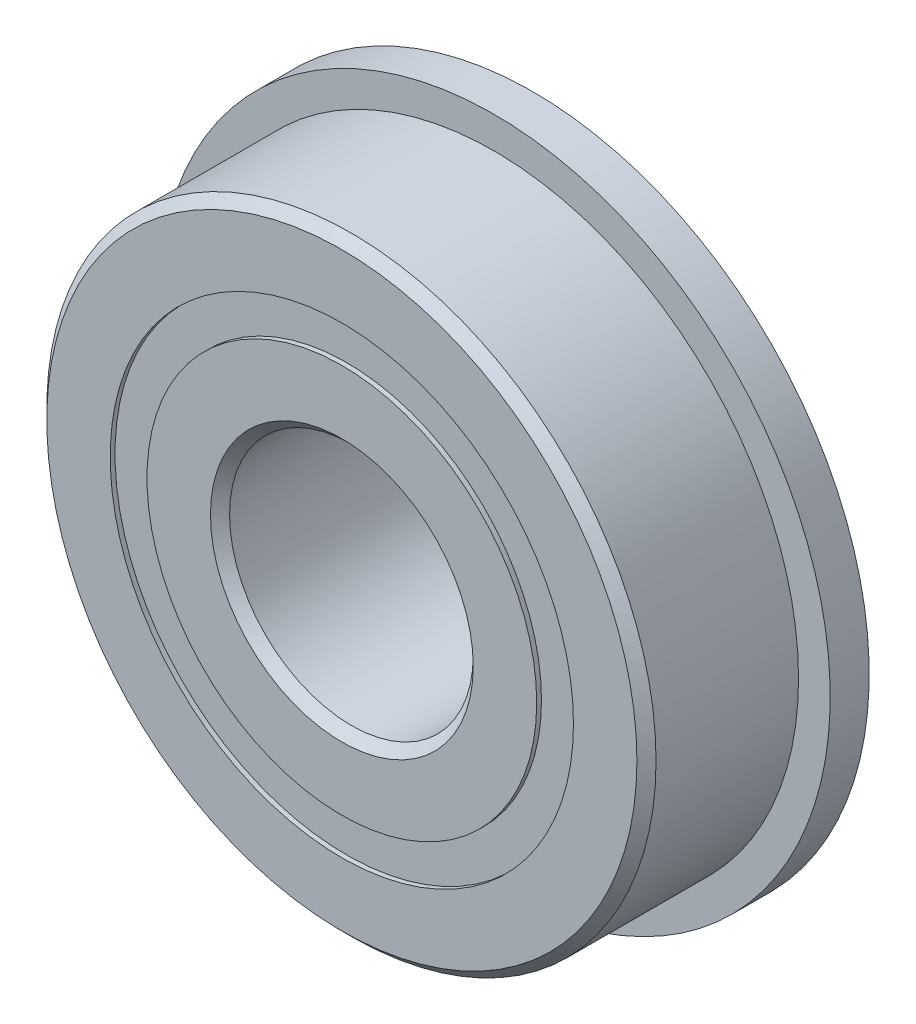
ISO-10303-21;
HEADER;
FILE_DESCRIPTION(('STEP AP214'),'2;1');
FILE_NAME('part.step','',(''),(''),'','','');
FILE_SCHEMA(('AUTOMOTIVE_DESIGN { 1 0 10303 214 1 1 1 1 }'));
ENDSEC;
DATA;
#1=APPLICATION_CONTEXT('core data for automotive mechanical design processes');
#2=APPLICATION_PROTOCOL_DEFINITION('international standard','automotive_design',2000,#1);
#3=PRODUCT_CONTEXT('',#1,'mechanical');
#4=PRODUCT('Part','Part','',(#3));
#5=PRODUCT_RELATED_PRODUCT_CATEGORY('part','',(#4));
#6=PRODUCT_DEFINITION_FORMATION('','',#4);
#7=PRODUCT_DEFINITION_CONTEXT('part definition',#1,'design');
#8=PRODUCT_DEFINITION('design','',#6,#7);
#9=PRODUCT_DEFINITION_SHAPE('','',#8);
#10=(LENGTH_UNIT() NAMED_UNIT(*) SI_UNIT(.MILLI.,.METRE.));
#11=(NAMED_UNIT(*) PLANE_ANGLE_UNIT() SI_UNIT($,.RADIAN.));
#12=(NAMED_UNIT(*) SI_UNIT($,.STERADIAN.) SOLID_ANGLE_UNIT());
#13=UNCERTAINTY_MEASURE_WITH_UNIT(LENGTH_MEASURE(1.E-05),#10,'distance_accuracy_value','');
#14=(GEOMETRIC_REPRESENTATION_CONTEXT(3) GLOBAL_UNCERTAINTY_ASSIGNED_CONTEXT((#13)) GLOBAL_UNIT_ASSIGNED_CONTEXT((#10,
#11,#12)) REPRESENTATION_CONTEXT('',''));
#15=CARTESIAN_POINT('',(0.,0.,0.));
#16=DIRECTION('',(0.,0.,1.));
#17=DIRECTION('',(1.,0.,0.));
#18=AXIS2_PLACEMENT_3D('',#15,#16,#17);
#19=CARTESIAN_POINT('',(0.,6.03522142857143,-2.36474));
#20=DIRECTION('',(0.,0.,1.));
#21=DIRECTION('',(1.,0.,0.));
#22=AXIS2_PLACEMENT_3D('',#19,#20,#21);
#23=PLANE('',#22);
#24=CARTESIAN_POINT('',(0.,0.,-2.36474));
#25=DIRECTION('',(0.,0.,1.));
#26=DIRECTION('',(1.,0.,0.));
#27=AXIS2_PLACEMENT_3D('',#24,#25,#26);
#28=CIRCLE('',#27,6.03522142857143);
#29=CARTESIAN_POINT('',(6.03522142857143,0.,-2.36474));
#30=VERTEX_POINT('',#29);
#31=EDGE_CURVE('E68',#30,#30,#28,.T.);
#32=ORIENTED_EDGE('',*,*,#31,.F.);
#33=EDGE_LOOP('',(#32));
#34=FACE_BOUND('',#33,.T.);
#35=CARTESIAN_POINT('',(0.,0.,-2.36474));
#36=DIRECTION('',(0.,0.,1.));
#37=DIRECTION('',(1.,0.,0.));
#38=AXIS2_PLACEMENT_3D('',#35,#36,#37);
#39=CIRCLE('',#38,5.07727857142857);
#40=CARTESIAN_POINT('',(5.07727857142857,0.,-2.36474));
#41=VERTEX_POINT('',#40);
#42=EDGE_CURVE('E11',#41,#41,#39,.T.);
#43=ORIENTED_EDGE('',*,*,#42,.T.);
#44=EDGE_LOOP('',(#43));
#45=FACE_BOUND('',#44,.T.);
#46=ADVANCED_FACE('F49',(#34,#45),#23,.F.);
#47=CARTESIAN_POINT('',(0.,0.,2.4892));
#48=DIRECTION('',(0.,0.,1.));
#49=DIRECTION('',(1.,0.,0.));
#50=AXIS2_PLACEMENT_3D('',#47,#48,#49);
#51=CYLINDRICAL_SURFACE('',#50,5.07727857142857);
#52=ORIENTED_EDGE('',*,*,#42,.F.);
#53=EDGE_LOOP('',(#52));
#54=FACE_BOUND('',#53,.T.);
#55=CARTESIAN_POINT('',(0.,0.,-1.20554465033679));
#56=DIRECTION('',(0.,0.,1.));
#57=DIRECTION('',(1.,0.,0.));
#58=AXIS2_PLACEMENT_3D('',#55,#56,#57);
#59=CIRCLE('',#58,5.07727857142857);
#60=CARTESIAN_POINT('',(5.07727857142857,0.,-1.20554465033679));
#61=VERTEX_POINT('',#60);
#62=EDGE_CURVE('E56',#61,#61,#59,.T.);
#63=ORIENTED_EDGE('',*,*,#62,.T.);
#64=EDGE_LOOP('',(#63));
#65=FACE_BOUND('',#64,.T.);
#66=ADVANCED_FACE('F79',(#54,#65),#51,.F.);
#67=CARTESIAN_POINT('',(0.,6.03522142857143,-1.20554465033679));
#68=DIRECTION('',(0.,0.,-1.));
#69=DIRECTION('',(-1.,0.,0.));
#70=AXIS2_PLACEMENT_3D('',#67,#68,#69);
#71=PLANE('',#70);
#72=ORIENTED_EDGE('',*,*,#62,.F.);
#73=EDGE_LOOP('',(#72));
#74=FACE_BOUND('',#73,.T.);
#75=CARTESIAN_POINT('',(0.,0.,-1.20554465033679));
#76=DIRECTION('',(0.,0.,1.));
#77=DIRECTION('',(1.,0.,0.));
#78=AXIS2_PLACEMENT_3D('',#75,#76,#77);
#79=CIRCLE('',#78,6.03522142857143);
#80=CARTESIAN_POINT('',(6.03522142857143,0.,-1.20554465033679));
#81=VERTEX_POINT('',#80);
#82=EDGE_CURVE('E62',#81,#81,#79,.T.);
#83=ORIENTED_EDGE('',*,*,#82,.T.);
#84=EDGE_LOOP('',(#83));
#85=FACE_BOUND('',#84,.T.);
#86=ADVANCED_FACE('F83',(#74,#85),#71,.F.);
#87=CARTESIAN_POINT('',(0.,0.,2.4892));
#88=DIRECTION('',(0.,0.,1.));
#89=DIRECTION('',(1.,0.,0.));
#90=AXIS2_PLACEMENT_3D('',#87,#88,#89);
#91=CYLINDRICAL_SURFACE('',#90,6.03522142857143);
#92=ORIENTED_EDGE('',*,*,#82,.F.);
#93=EDGE_LOOP('',(#92));
#94=FACE_BOUND('',#93,.T.);
#95=ORIENTED_EDGE('',*,*,#31,.T.);
#96=EDGE_LOOP('',(#95));
#97=FACE_BOUND('',#96,.T.);
#98=ADVANCED_FACE('F76',(#94,#97),#91,.T.);
#99=CLOSED_SHELL('',(#46,#66,#86,#98));
#100=MANIFOLD_SOLID_BREP('B2',#99);
#101=CARTESIAN_POINT('',(0.,6.03522142857143,2.36474));
#102=DIRECTION('',(0.,0.,-1.));
#103=DIRECTION('',(-1.,0.,0.));
#104=AXIS2_PLACEMENT_3D('',#101,#102,#103);
#105=PLANE('',#104);
#106=CARTESIAN_POINT('',(0.,0.,2.36474));
#107=DIRECTION('',(0.,0.,1.));
#108=DIRECTION('',(1.,0.,0.));
#109=AXIS2_PLACEMENT_3D('',#106,#107,#108);
#110=CIRCLE('',#109,5.07727857142857);
#111=CARTESIAN_POINT('',(5.07727857142857,0.,2.36474));
#112=VERTEX_POINT('',#111);
#113=EDGE_CURVE('E48',#112,#112,#110,.T.);
#114=ORIENTED_EDGE('',*,*,#113,.F.);
#115=EDGE_LOOP('',(#114));
#116=FACE_BOUND('',#115,.T.);
#117=CARTESIAN_POINT('',(0.,0.,2.36474));
#118=DIRECTION('',(0.,0.,1.));
#119=DIRECTION('',(1.,0.,0.));
#120=AXIS2_PLACEMENT_3D('',#117,#118,#119);
#121=CIRCLE('',#120,6.03522142857143);
#122=CARTESIAN_POINT('',(6.03522142857143,0.,2.36474));
#123=VERTEX_POINT('',#122);
#124=EDGE_CURVE('E151',#123,#123,#121,.T.);
#125=ORIENTED_EDGE('',*,*,#124,.T.);
#126=EDGE_LOOP('',(#125));
#127=FACE_BOUND('',#126,.T.);
#128=ADVANCED_FACE('F132',(#116,#127),#105,.F.);
#129=CARTESIAN_POINT('',(0.,0.,2.4892));
#130=DIRECTION('',(0.,0.,1.));
#131=DIRECTION('',(1.,0.,0.));
#132=AXIS2_PLACEMENT_3D('',#129,#130,#131);
#133=CYLINDRICAL_SURFACE('',#132,5.07727857142857);
#134=CARTESIAN_POINT('',(0.,0.,1.20554465033679));
#135=DIRECTION('',(0.,0.,1.));
#136=DIRECTION('',(1.,0.,0.));
#137=AXIS2_PLACEMENT_3D('',#134,#135,#136);
#138=CIRCLE('',#137,5.07727857142857);
#139=CARTESIAN_POINT('',(5.07727857142857,0.,1.20554465033679));
#140=VERTEX_POINT('',#139);
#141=EDGE_CURVE('E139',#140,#140,#138,.T.);
#142=ORIENTED_EDGE('',*,*,#141,.F.);
#143=EDGE_LOOP('',(#142));
#144=FACE_BOUND('',#143,.T.);
#145=ORIENTED_EDGE('',*,*,#113,.T.);
#146=EDGE_LOOP('',(#145));
#147=FACE_BOUND('',#146,.T.);
#148=ADVANCED_FACE('F168',(#144,#147),#133,.F.);
#149=CARTESIAN_POINT('',(0.,6.03522142857143,1.20554465033679));
#150=DIRECTION('',(0.,0.,1.));
#151=DIRECTION('',(1.,0.,0.));
#152=AXIS2_PLACEMENT_3D('',#149,#150,#151);
#153=PLANE('',#152);
#154=CARTESIAN_POINT('',(0.,0.,1.20554465033679));
#155=DIRECTION('',(0.,0.,1.));
#156=DIRECTION('',(1.,0.,0.));
#157=AXIS2_PLACEMENT_3D('',#154,#155,#156);
#158=CIRCLE('',#157,6.03522142857143);
#159=CARTESIAN_POINT('',(6.03522142857143,0.,1.20554465033679));
#160=VERTEX_POINT('',#159);
#161=EDGE_CURVE('E145',#160,#160,#158,.T.);
#162=ORIENTED_EDGE('',*,*,#161,.F.);
#163=EDGE_LOOP('',(#162));
#164=FACE_BOUND('',#163,.T.);
#165=ORIENTED_EDGE('',*,*,#141,.T.);
#166=EDGE_LOOP('',(#165));
#167=FACE_BOUND('',#166,.T.);
#168=ADVANCED_FACE('F163',(#164,#167),#153,.F.);
#169=CARTESIAN_POINT('',(0.,0.,2.4892));
#170=DIRECTION('',(0.,0.,1.));
#171=DIRECTION('',(1.,0.,0.));
#172=AXIS2_PLACEMENT_3D('',#169,#170,#171);
#173=CYLINDRICAL_SURFACE('',#172,6.03522142857143);
#174=ORIENTED_EDGE('',*,*,#124,.F.);
#175=EDGE_LOOP('',(#174));
#176=FACE_BOUND('',#175,.T.);
#177=ORIENTED_EDGE('',*,*,#161,.T.);
#178=EDGE_LOOP('',(#177));
#179=FACE_BOUND('',#178,.T.);
#180=ADVANCED_FACE('F160',(#176,#179),#173,.T.);
#181=CLOSED_SHELL('',(#128,#148,#168,#180));
#182=MANIFOLD_SOLID_BREP('B6',#181);
#183=CARTESIAN_POINT('',(-2.41076652547187,5.00600827228285,0.));
#184=DIRECTION('',(0.,0.,1.));
#185=DIRECTION('',(-0.433883739117546,0.900968867902425,0.));
#186=AXIS2_PLACEMENT_3D('',#183,#184,#185);
#187=SPHERICAL_SURFACE('',#186,1.20554465033679);
#188=CARTESIAN_POINT('',(-2.41076652547187,5.00600827228285,1.20554465033679));
#189=VERTEX_POINT('',#188);
#190=VERTEX_LOOP('',#189);
#191=FACE_BOUND('',#190,.T.);
#192=ADVANCED_FACE('F215',(#191),#187,.T.);
#193=CLOSED_SHELL('',(#192));
#194=MANIFOLD_SOLID_BREP('B43',#193);
#195=CARTESIAN_POINT('',(-4.34405117446295,3.46426521157764,0.));
#196=DIRECTION('',(0.,0.,1.));
#197=DIRECTION('',(-0.781831482468022,0.623489801858743,0.));
#198=AXIS2_PLACEMENT_3D('',#195,#196,#197);
#199=SPHERICAL_SURFACE('',#198,1.20554465033679);
#200=CARTESIAN_POINT('',(-4.34405117446295,3.46426521157764,1.20554465033679));
#201=VERTEX_POINT('',#200);
#202=VERTEX_LOOP('',#201);
#203=FACE_BOUND('',#202,.T.);
#204=ADVANCED_FACE('F237',(#203),#199,.T.);
#205=CLOSED_SHELL('',(#204));
#206=MANIFOLD_SOLID_BREP('B128',#205);
#207=CARTESIAN_POINT('',(-5.41694321206024,1.23638193929483,0.));
#208=DIRECTION('',(0.,0.,1.));
#209=DIRECTION('',(-0.974927912181821,0.222520933956325,0.));
#210=AXIS2_PLACEMENT_3D('',#207,#208,#209);
#211=SPHERICAL_SURFACE('',#210,1.20554465033679);
#212=CARTESIAN_POINT('',(-5.41694321206024,1.23638193929483,1.20554465033679));
#213=VERTEX_POINT('',#212);
#214=VERTEX_LOOP('',#213);
#215=FACE_BOUND('',#214,.T.);
#216=ADVANCED_FACE('F259',(#215),#211,.T.);
#217=CLOSED_SHELL('',(#216));
#218=MANIFOLD_SOLID_BREP('B211',#217);
#219=CARTESIAN_POINT('',(-5.41694321206027,-1.23638193929472,0.));
#220=DIRECTION('',(0.,0.,1.));
#221=DIRECTION('',(-0.974927912181826,-0.222520933956305,0.));
#222=AXIS2_PLACEMENT_3D('',#219,#220,#221);
#223=SPHERICAL_SURFACE('',#222,1.20554465033679);
#224=CARTESIAN_POINT('',(-5.41694321206027,-1.23638193929472,1.20554465033679));
#225=VERTEX_POINT('',#224);
#226=VERTEX_LOOP('',#225);
#227=FACE_BOUND('',#226,.T.);
#228=ADVANCED_FACE('F281',(#227),#223,.T.);
#229=CLOSED_SHELL('',(#228));
#230=MANIFOLD_SOLID_BREP('B233',#229);
#231=CARTESIAN_POINT('',(-4.34405117446302,-3.46426521157755,0.));
#232=DIRECTION('',(0.,0.,1.));
#233=DIRECTION('',(-0.781831482468035,-0.623489801858727,0.));
#234=AXIS2_PLACEMENT_3D('',#231,#232,#233);
#235=SPHERICAL_SURFACE('',#234,1.20554465033679);
#236=CARTESIAN_POINT('',(-4.34405117446302,-3.46426521157755,1.20554465033679));
#237=VERTEX_POINT('',#236);
#238=VERTEX_LOOP('',#237);
#239=FACE_BOUND('',#238,.T.);
#240=ADVANCED_FACE('F303',(#239),#235,.T.);
#241=CLOSED_SHELL('',(#240));
#242=MANIFOLD_SOLID_BREP('B255',#241);
#243=CARTESIAN_POINT('',(-2.41076652547197,-5.0060082722828,0.));
#244=DIRECTION('',(0.,0.,1.));
#245=DIRECTION('',(-0.433883739117565,-0.900968867902416,0.));
#246=AXIS2_PLACEMENT_3D('',#243,#244,#245);
#247=SPHERICAL_SURFACE('',#246,1.20554465033679);
#248=CARTESIAN_POINT('',(-2.41076652547197,-5.0060082722828,1.20554465033679));
#249=VERTEX_POINT('',#248);
#250=VERTEX_LOOP('',#249);
#251=FACE_BOUND('',#250,.T.);
#252=ADVANCED_FACE('F325',(#251),#247,.T.);
#253=CLOSED_SHELL('',(#252));
#254=MANIFOLD_SOLID_BREP('B277',#253);
#255=CARTESIAN_POINT('',(0.,-5.55625,0.));
#256=DIRECTION('',(0.,0.,1.));
#257=DIRECTION('',(0.,-1.,0.));
#258=AXIS2_PLACEMENT_3D('',#255,#256,#257);
#259=SPHERICAL_SURFACE('',#258,1.20554465033679);
#260=CARTESIAN_POINT('',(0.,-5.55625,1.20554465033679));
#261=VERTEX_POINT('',#260);
#262=VERTEX_LOOP('',#261);
#263=FACE_BOUND('',#262,.T.);
#264=ADVANCED_FACE('F347',(#263),#259,.T.);
#265=CLOSED_SHELL('',(#264));
#266=MANIFOLD_SOLID_BREP('B299',#265);
#267=CARTESIAN_POINT('',(2.4107665254719,-5.00600827228283,0.));
#268=DIRECTION('',(0.,0.,1.));
#269=DIRECTION('',(0.433883739117553,-0.900968867902422,0.));
#270=AXIS2_PLACEMENT_3D('',#267,#268,#269);
#271=SPHERICAL_SURFACE('',#270,1.20554465033679);
#272=CARTESIAN_POINT('',(2.4107665254719,-5.00600827228283,1.20554465033679));
#273=VERTEX_POINT('',#272);
#274=VERTEX_LOOP('',#273);
#275=FACE_BOUND('',#274,.T.);
#276=ADVANCED_FACE('F369',(#275),#271,.T.);
#277=CLOSED_SHELL('',(#276));
#278=MANIFOLD_SOLID_BREP('B321',#277);
#279=CARTESIAN_POINT('',(4.34405117446297,-3.46426521157761,0.));
#280=DIRECTION('',(0.,0.,1.));
#281=DIRECTION('',(0.781831482468027,-0.623489801858737,0.));
#282=AXIS2_PLACEMENT_3D('',#279,#280,#281);
#283=SPHERICAL_SURFACE('',#282,1.20554465033679);
#284=CARTESIAN_POINT('',(4.34405117446297,-3.46426521157761,1.20554465033679));
#285=VERTEX_POINT('',#284);
#286=VERTEX_LOOP('',#285);
#287=FACE_BOUND('',#286,.T.);
#288=ADVANCED_FACE('F391',(#287),#283,.T.);
#289=CLOSED_SHELL('',(#288));
#290=MANIFOLD_SOLID_BREP('B343',#289);
#291=CARTESIAN_POINT('',(5.41694321206025,-1.23638193929479,0.));
#292=DIRECTION('',(0.,0.,1.));
#293=DIRECTION('',(0.974927912181823,-0.222520933956318,0.));
#294=AXIS2_PLACEMENT_3D('',#291,#292,#293);
#295=SPHERICAL_SURFACE('',#294,1.20554465033679);
#296=CARTESIAN_POINT('',(5.41694321206025,-1.23638193929479,1.20554465033679));
#297=VERTEX_POINT('',#296);
#298=VERTEX_LOOP('',#297);
#299=FACE_BOUND('',#298,.T.);
#300=ADVANCED_FACE('F413',(#299),#295,.T.);
#301=CLOSED_SHELL('',(#300));
#302=MANIFOLD_SOLID_BREP('B365',#301);
#303=CARTESIAN_POINT('',(5.41694321206026,1.23638193929476,0.));
#304=DIRECTION('',(0.,0.,1.));
#305=DIRECTION('',(0.974927912181824,0.222520933956311,0.));
#306=AXIS2_PLACEMENT_3D('',#303,#304,#305);
#307=SPHERICAL_SURFACE('',#306,1.20554465033679);
#308=CARTESIAN_POINT('',(5.41694321206026,1.23638193929476,1.20554465033679));
#309=VERTEX_POINT('',#308);
#310=VERTEX_LOOP('',#309);
#311=FACE_BOUND('',#310,.T.);
#312=ADVANCED_FACE('F435',(#311),#307,.T.);
#313=CLOSED_SHELL('',(#312));
#314=MANIFOLD_SOLID_BREP('B387',#313);
#315=CARTESIAN_POINT('',(4.344051174463,3.46426521157758,0.));
#316=DIRECTION('',(0.,0.,1.));
#317=DIRECTION('',(0.781831482468031,0.623489801858732,0.));
#318=AXIS2_PLACEMENT_3D('',#315,#316,#317);
#319=SPHERICAL_SURFACE('',#318,1.20554465033679);
#320=CARTESIAN_POINT('',(4.344051174463,3.46426521157758,1.20554465033679));
#321=VERTEX_POINT('',#320);
#322=VERTEX_LOOP('',#321);
#323=FACE_BOUND('',#322,.T.);
#324=ADVANCED_FACE('F457',(#323),#319,.T.);
#325=CLOSED_SHELL('',(#324));
#326=MANIFOLD_SOLID_BREP('B409',#325);
#327=CARTESIAN_POINT('',(2.41076652547194,5.00600827228281,0.));
#328=DIRECTION('',(0.,0.,1.));
#329=DIRECTION('',(0.433883739117559,0.900968867902419,0.));
#330=AXIS2_PLACEMENT_3D('',#327,#328,#329);
#331=SPHERICAL_SURFACE('',#330,1.20554465033679);
#332=CARTESIAN_POINT('',(2.41076652547194,5.00600827228281,1.20554465033679));
#333=VERTEX_POINT('',#332);
#334=VERTEX_LOOP('',#333);
#335=FACE_BOUND('',#334,.T.);
#336=ADVANCED_FACE('F479',(#335),#331,.T.);
#337=CLOSED_SHELL('',(#336));
#338=MANIFOLD_SOLID_BREP('B431',#337);
#339=CARTESIAN_POINT('',(0.,5.55625,0.));
#340=DIRECTION('',(0.,0.,1.));
#341=DIRECTION('',(0.,1.,0.));
#342=AXIS2_PLACEMENT_3D('',#339,#340,#341);
#343=SPHERICAL_SURFACE('',#342,1.20554465033679);
#344=CARTESIAN_POINT('',(0.,5.55625,1.20554465033679));
#345=VERTEX_POINT('',#344);
#346=VERTEX_LOOP('',#345);
#347=FACE_BOUND('',#346,.T.);
#348=ADVANCED_FACE('F503',(#347),#343,.T.);
#349=CLOSED_SHELL('',(#348));
#350=MANIFOLD_SOLID_BREP('B453',#349);
#351=CARTESIAN_POINT('',(0.,5.07727857142857,2.4892));
#352=DIRECTION('',(0.,0.,-1.));
#353=DIRECTION('',(-1.,0.,0.));
#354=AXIS2_PLACEMENT_3D('',#351,#352,#353);
#355=PLANE('',#354);
#356=CARTESIAN_POINT('',(0.,0.,2.4892));
#357=DIRECTION('',(0.,0.,1.));
#358=DIRECTION('',(1.,0.,0.));
#359=AXIS2_PLACEMENT_3D('',#356,#357,#358);
#360=CIRCLE('',#359,3.42392);
#361=CARTESIAN_POINT('',(3.42392,0.,2.4892));
#362=VERTEX_POINT('',#361);
#363=EDGE_CURVE('E561',#362,#362,#360,.T.);
#364=ORIENTED_EDGE('',*,*,#363,.F.);
#365=EDGE_LOOP('',(#364));
#366=FACE_BOUND('',#365,.T.);
#367=CARTESIAN_POINT('',(0.,0.,2.4892));
#368=DIRECTION('',(0.,0.,1.));
#369=DIRECTION('',(1.,0.,0.));
#370=AXIS2_PLACEMENT_3D('',#367,#368,#369);
#371=CIRCLE('',#370,5.07727857142857);
#372=CARTESIAN_POINT('',(5.07727857142857,0.,2.4892));
#373=VERTEX_POINT('',#372);
#374=EDGE_CURVE('E502',#373,#373,#371,.T.);
#375=ORIENTED_EDGE('',*,*,#374,.T.);
#376=EDGE_LOOP('',(#375));
#377=FACE_BOUND('',#376,.T.);
#378=ADVANCED_FACE('F524',(#366,#377),#355,.F.);
#379=CARTESIAN_POINT('',(0.,0.,2.4892));
#380=DIRECTION('',(0.,0.,1.));
#381=DIRECTION('',(1.,0.,0.));
#382=AXIS2_PLACEMENT_3D('',#379,#380,#381);
#383=CYLINDRICAL_SURFACE('',#382,5.07727857142857);
#384=ORIENTED_EDGE('',*,*,#374,.F.);
#385=EDGE_LOOP('',(#384));
#386=FACE_BOUND('',#385,.T.);
#387=CARTESIAN_POINT('',(0.,0.,1.10631111111111));
#388=DIRECTION('',(0.,0.,1.));
#389=DIRECTION('',(1.,0.,0.));
#390=AXIS2_PLACEMENT_3D('',#387,#388,#389);
#391=CIRCLE('',#390,5.07727857142857);
#392=CARTESIAN_POINT('',(5.07727857142857,0.,1.10631111111111));
#393=VERTEX_POINT('',#392);
#394=EDGE_CURVE('E531',#393,#393,#391,.T.);
#395=ORIENTED_EDGE('',*,*,#394,.T.);
#396=EDGE_LOOP('',(#395));
#397=FACE_BOUND('',#396,.T.);
#398=ADVANCED_FACE('F570',(#386,#397),#383,.T.);
#399=CARTESIAN_POINT('',(0.,0.,0.));
#400=DIRECTION('',(0.,0.,1.));
#401=DIRECTION('',(1.,0.,0.));
#402=AXIS2_PLACEMENT_3D('',#399,#400,#401);
#403=TOROIDAL_SURFACE('',#402,5.55625,1.20554465033679);
#404=ORIENTED_EDGE('',*,*,#394,.F.);
#405=EDGE_LOOP('',(#404));
#406=FACE_BOUND('',#405,.T.);
#407=CARTESIAN_POINT('',(0.,0.,-1.10631111111111));
#408=DIRECTION('',(0.,0.,1.));
#409=DIRECTION('',(1.,0.,0.));
#410=AXIS2_PLACEMENT_3D('',#407,#408,#409);
#411=CIRCLE('',#410,5.07727857142857);
#412=CARTESIAN_POINT('',(5.07727857142857,0.,-1.10631111111111));
#413=VERTEX_POINT('',#412);
#414=EDGE_CURVE('E537',#413,#413,#411,.T.);
#415=ORIENTED_EDGE('',*,*,#414,.T.);
#416=EDGE_LOOP('',(#415));
#417=FACE_BOUND('',#416,.T.);
#418=ADVANCED_FACE('F574',(#406,#417),#403,.F.);
#419=CARTESIAN_POINT('',(0.,0.,2.4892));
#420=DIRECTION('',(0.,0.,1.));
#421=DIRECTION('',(1.,0.,0.));
#422=AXIS2_PLACEMENT_3D('',#419,#420,#421);
#423=CYLINDRICAL_SURFACE('',#422,5.07727857142857);
#424=ORIENTED_EDGE('',*,*,#414,.F.);
#425=EDGE_LOOP('',(#424));
#426=FACE_BOUND('',#425,.T.);
#427=CARTESIAN_POINT('',(0.,0.,-2.4892));
#428=DIRECTION('',(0.,0.,1.));
#429=DIRECTION('',(1.,0.,0.));
#430=AXIS2_PLACEMENT_3D('',#427,#428,#429);
#431=CIRCLE('',#430,5.07727857142857);
#432=CARTESIAN_POINT('',(5.07727857142857,0.,-2.4892));
#433=VERTEX_POINT('',#432);
#434=EDGE_CURVE('E543',#433,#433,#431,.T.);
#435=ORIENTED_EDGE('',*,*,#434,.T.);
#436=EDGE_LOOP('',(#435));
#437=FACE_BOUND('',#436,.T.);
#438=ADVANCED_FACE('F579',(#426,#437),#423,.T.);
#439=CARTESIAN_POINT('',(0.,3.42392,-2.4892));
#440=DIRECTION('',(0.,0.,1.));
#441=DIRECTION('',(1.,0.,0.));
#442=AXIS2_PLACEMENT_3D('',#439,#440,#441);
#443=PLANE('',#442);
#444=ORIENTED_EDGE('',*,*,#434,.F.);
#445=EDGE_LOOP('',(#444));
#446=FACE_BOUND('',#445,.T.);
#447=CARTESIAN_POINT('',(0.,0.,-2.4892));
#448=DIRECTION('',(0.,0.,1.));
#449=DIRECTION('',(1.,0.,0.));
#450=AXIS2_PLACEMENT_3D('',#447,#448,#449);
#451=CIRCLE('',#450,3.42392);
#452=CARTESIAN_POINT('',(3.42392,0.,-2.4892));
#453=VERTEX_POINT('',#452);
#454=EDGE_CURVE('E549',#453,#453,#451,.T.);
#455=ORIENTED_EDGE('',*,*,#454,.T.);
#456=EDGE_LOOP('',(#455));
#457=FACE_BOUND('',#456,.T.);
#458=ADVANCED_FACE('F585',(#446,#457),#443,.F.);
#459=CARTESIAN_POINT('',(0.,0.,-2.24028));
#460=DIRECTION('',(0.,0.,-1.));
#461=DIRECTION('',(-1.,0.,0.));
#462=AXIS2_PLACEMENT_3D('',#459,#460,#461);
#463=CONICAL_SURFACE('',#462,3.175,0.785398163397448);
#464=ORIENTED_EDGE('',*,*,#454,.F.);
#465=EDGE_LOOP('',(#464));
#466=FACE_BOUND('',#465,.T.);
#467=CARTESIAN_POINT('',(0.,0.,-2.24028));
#468=DIRECTION('',(0.,0.,1.));
#469=DIRECTION('',(1.,0.,0.));
#470=AXIS2_PLACEMENT_3D('',#467,#468,#469);
#471=CIRCLE('',#470,3.175);
#472=CARTESIAN_POINT('',(3.175,0.,-2.24028));
#473=VERTEX_POINT('',#472);
#474=EDGE_CURVE('E553',#473,#473,#471,.T.);
#475=ORIENTED_EDGE('',*,*,#474,.T.);
#476=EDGE_LOOP('',(#475));
#477=FACE_BOUND('',#476,.T.);
#478=ADVANCED_FACE('F589',(#466,#477),#463,.F.);
#479=CARTESIAN_POINT('',(0.,0.,2.4892));
#480=DIRECTION('',(0.,0.,1.));
#481=DIRECTION('',(1.,0.,0.));
#482=AXIS2_PLACEMENT_3D('',#479,#480,#481);
#483=CYLINDRICAL_SURFACE('',#482,3.175);
#484=ORIENTED_EDGE('',*,*,#474,.F.);
#485=EDGE_LOOP('',(#484));
#486=FACE_BOUND('',#485,.T.);
#487=CARTESIAN_POINT('',(0.,0.,2.24028));
#488=DIRECTION('',(0.,0.,1.));
#489=DIRECTION('',(1.,0.,0.));
#490=AXIS2_PLACEMENT_3D('',#487,#488,#489);
#491=CIRCLE('',#490,3.175);
#492=CARTESIAN_POINT('',(3.175,0.,2.24028));
#493=VERTEX_POINT('',#492);
#494=EDGE_CURVE('E557',#493,#493,#491,.T.);
#495=ORIENTED_EDGE('',*,*,#494,.T.);
#496=EDGE_LOOP('',(#495));
#497=FACE_BOUND('',#496,.T.);
#498=ADVANCED_FACE('F593',(#486,#497),#483,.F.);
#499=CARTESIAN_POINT('',(0.,0.,2.4892));
#500=DIRECTION('',(0.,0.,1.));
#501=DIRECTION('',(1.,0.,0.));
#502=AXIS2_PLACEMENT_3D('',#499,#500,#501);
#503=CONICAL_SURFACE('',#502,3.42392,0.785398163397448);
#504=ORIENTED_EDGE('',*,*,#494,.F.);
#505=EDGE_LOOP('',(#504));
#506=FACE_BOUND('',#505,.T.);
#507=ORIENTED_EDGE('',*,*,#363,.T.);
#508=EDGE_LOOP('',(#507));
#509=FACE_BOUND('',#508,.T.);
#510=ADVANCED_FACE('F567',(#506,#509),#503,.F.);
#511=CLOSED_SHELL('',(#378,#398,#418,#438,#458,#478,#498,#510));
#512=MANIFOLD_SOLID_BREP('B475',#511);
#513=CARTESIAN_POINT('',(0.,0.,2.24028));
#514=DIRECTION('',(0.,0.,-1.));
#515=DIRECTION('',(-1.,0.,0.));
#516=AXIS2_PLACEMENT_3D('',#513,#514,#515);
#517=CONICAL_SURFACE('',#516,7.9375,0.785398163397447);
#518=CARTESIAN_POINT('',(0.,0.,2.4892));
#519=DIRECTION('',(0.,0.,1.));
#520=DIRECTION('',(1.,0.,0.));
#521=AXIS2_PLACEMENT_3D('',#518,#519,#520);
#522=CIRCLE('',#521,7.68858);
#523=CARTESIAN_POINT('',(7.68858,0.,2.4892));
#524=VERTEX_POINT('',#523);
#525=EDGE_CURVE('E706',#524,#524,#522,.T.);
#526=ORIENTED_EDGE('',*,*,#525,.F.);
#527=EDGE_LOOP('',(#526));
#528=FACE_BOUND('',#527,.T.);
#529=CARTESIAN_POINT('',(0.,0.,2.24028));
#530=DIRECTION('',(0.,0.,1.));
#531=DIRECTION('',(1.,0.,0.));
#532=AXIS2_PLACEMENT_3D('',#529,#530,#531);
#533=CIRCLE('',#532,7.9375);
#534=CARTESIAN_POINT('',(7.9375,0.,2.24028));
#535=VERTEX_POINT('',#534);
#536=EDGE_CURVE('E523',#535,#535,#533,.T.);
#537=ORIENTED_EDGE('',*,*,#536,.T.);
#538=EDGE_LOOP('',(#537));
#539=FACE_BOUND('',#538,.T.);
#540=ADVANCED_FACE('F677',(#528,#539),#517,.T.);
#541=CARTESIAN_POINT('',(0.,0.,2.4892));
#542=DIRECTION('',(0.,0.,1.));
#543=DIRECTION('',(1.,0.,0.));
#544=AXIS2_PLACEMENT_3D('',#541,#542,#543);
#545=CYLINDRICAL_SURFACE('',#544,7.9375);
#546=CARTESIAN_POINT('',(0.,0.,-1.4732));
#547=DIRECTION('',(0.,0.,1.));
#548=DIRECTION('',(1.,0.,0.));
#549=AXIS2_PLACEMENT_3D('',#546,#547,#548);
#550=CIRCLE('',#549,7.9375);
#551=CARTESIAN_POINT('',(7.9375,0.,-1.4732));
#552=VERTEX_POINT('',#551);
#553=EDGE_CURVE('E710',#552,#552,#550,.T.);
#554=ORIENTED_EDGE('',*,*,#553,.T.);
#555=EDGE_LOOP('',(#554));
#556=FACE_BOUND('',#555,.T.);
#557=ORIENTED_EDGE('',*,*,#536,.F.);
#558=EDGE_LOOP('',(#557));
#559=FACE_BOUND('',#558,.T.);
#560=ADVANCED_FACE('F734',(#556,#559),#545,.T.);
#561=CARTESIAN_POINT('',(0.,7.68858,-2.4892));
#562=DIRECTION('',(0.,0.,1.));
#563=DIRECTION('',(1.,0.,0.));
#564=AXIS2_PLACEMENT_3D('',#561,#562,#563);
#565=PLANE('',#564);
#566=CARTESIAN_POINT('',(0.,0.,-2.4892));
#567=DIRECTION('',(0.,0.,1.));
#568=DIRECTION('',(1.,0.,0.));
#569=AXIS2_PLACEMENT_3D('',#566,#567,#568);
#570=CIRCLE('',#569,6.03522142857143);
#571=CARTESIAN_POINT('',(6.03522142857143,0.,-2.4892));
#572=VERTEX_POINT('',#571);
#573=EDGE_CURVE('E684',#572,#572,#570,.T.);
#574=ORIENTED_EDGE('',*,*,#573,.T.);
#575=EDGE_LOOP('',(#574));
#576=FACE_BOUND('',#575,.T.);
#577=CARTESIAN_POINT('',(0.,0.,-2.4892));
#578=DIRECTION('',(0.,0.,-1.));
#579=DIRECTION('',(-1.,0.,0.));
#580=AXIS2_PLACEMENT_3D('',#577,#578,#579);
#581=CIRCLE('',#580,8.763);
#582=CARTESIAN_POINT('',(-8.763,0.,-2.4892));
#583=VERTEX_POINT('',#582);
#584=EDGE_CURVE('E714',#583,#583,#581,.T.);
#585=ORIENTED_EDGE('',*,*,#584,.T.);
#586=EDGE_LOOP('',(#585));
#587=FACE_BOUND('',#586,.T.);
#588=ADVANCED_FACE('F737',(#576,#587),#565,.F.);
#589=CARTESIAN_POINT('',(0.,0.,2.4892));
#590=DIRECTION('',(0.,0.,1.));
#591=DIRECTION('',(1.,0.,0.));
#592=AXIS2_PLACEMENT_3D('',#589,#590,#591);
#593=CYLINDRICAL_SURFACE('',#592,6.03522142857143);
#594=CARTESIAN_POINT('',(0.,0.,-1.10631111111111));
#595=DIRECTION('',(0.,0.,1.));
#596=DIRECTION('',(1.,0.,0.));
#597=AXIS2_PLACEMENT_3D('',#594,#595,#596);
#598=CIRCLE('',#597,6.03522142857143);
#599=CARTESIAN_POINT('',(6.03522142857143,0.,-1.10631111111111));
#600=VERTEX_POINT('',#599);
#601=EDGE_CURVE('E690',#600,#600,#598,.T.);
#602=ORIENTED_EDGE('',*,*,#601,.T.);
#603=EDGE_LOOP('',(#602));
#604=FACE_BOUND('',#603,.T.);
#605=ORIENTED_EDGE('',*,*,#573,.F.);
#606=EDGE_LOOP('',(#605));
#607=FACE_BOUND('',#606,.T.);
#608=ADVANCED_FACE('F742',(#604,#607),#593,.F.);
#609=CARTESIAN_POINT('',(0.,0.,0.));
#610=DIRECTION('',(0.,0.,1.));
#611=DIRECTION('',(1.,0.,0.));
#612=AXIS2_PLACEMENT_3D('',#609,#610,#611);
#613=TOROIDAL_SURFACE('',#612,5.55625,1.20554465033679);
#614=ORIENTED_EDGE('',*,*,#601,.F.);
#615=EDGE_LOOP('',(#614));
#616=FACE_BOUND('',#615,.T.);
#617=CARTESIAN_POINT('',(0.,0.,1.10631111111111));
#618=DIRECTION('',(0.,0.,1.));
#619=DIRECTION('',(1.,0.,0.));
#620=AXIS2_PLACEMENT_3D('',#617,#618,#619);
#621=CIRCLE('',#620,6.03522142857143);
#622=CARTESIAN_POINT('',(6.03522142857143,0.,1.10631111111111));
#623=VERTEX_POINT('',#622);
#624=EDGE_CURVE('E696',#623,#623,#621,.T.);
#625=ORIENTED_EDGE('',*,*,#624,.T.);
#626=EDGE_LOOP('',(#625));
#627=FACE_BOUND('',#626,.T.);
#628=ADVANCED_FACE('F748',(#616,#627),#613,.F.);
#629=CARTESIAN_POINT('',(0.,0.,2.4892));
#630=DIRECTION('',(0.,0.,1.));
#631=DIRECTION('',(1.,0.,0.));
#632=AXIS2_PLACEMENT_3D('',#629,#630,#631);
#633=CYLINDRICAL_SURFACE('',#632,6.03522142857143);
#634=ORIENTED_EDGE('',*,*,#624,.F.);
#635=EDGE_LOOP('',(#634));
#636=FACE_BOUND('',#635,.T.);
#637=CARTESIAN_POINT('',(0.,0.,2.4892));
#638=DIRECTION('',(0.,0.,1.));
#639=DIRECTION('',(1.,0.,0.));
#640=AXIS2_PLACEMENT_3D('',#637,#638,#639);
#641=CIRCLE('',#640,6.03522142857143);
#642=CARTESIAN_POINT('',(6.03522142857143,0.,2.4892));
#643=VERTEX_POINT('',#642);
#644=EDGE_CURVE('E702',#643,#643,#641,.T.);
#645=ORIENTED_EDGE('',*,*,#644,.T.);
#646=EDGE_LOOP('',(#645));
#647=FACE_BOUND('',#646,.T.);
#648=ADVANCED_FACE('F752',(#636,#647),#633,.F.);
#649=CARTESIAN_POINT('',(0.,7.68858,2.4892));
#650=DIRECTION('',(0.,0.,-1.));
#651=DIRECTION('',(-1.,0.,0.));
#652=AXIS2_PLACEMENT_3D('',#649,#650,#651);
#653=PLANE('',#652);
#654=ORIENTED_EDGE('',*,*,#644,.F.);
#655=EDGE_LOOP('',(#654));
#656=FACE_BOUND('',#655,.T.);
#657=ORIENTED_EDGE('',*,*,#525,.T.);
#658=EDGE_LOOP('',(#657));
#659=FACE_BOUND('',#658,.T.);
#660=ADVANCED_FACE('F730',(#656,#659),#653,.F.);
#661=CARTESIAN_POINT('',(0.,6.03522142857143,-1.4732));
#662=DIRECTION('',(0.,0.,1.));
#663=DIRECTION('',(1.,0.,0.));
#664=AXIS2_PLACEMENT_3D('',#661,#662,#663);
#665=PLANE('',#664);
#666=CARTESIAN_POINT('',(0.,0.,-1.4732));
#667=DIRECTION('',(0.,0.,-1.));
#668=DIRECTION('',(-1.,0.,0.));
#669=AXIS2_PLACEMENT_3D('',#666,#667,#668);
#670=CIRCLE('',#669,8.763);
#671=CARTESIAN_POINT('',(-8.763,0.,-1.4732));
#672=VERTEX_POINT('',#671);
#673=EDGE_CURVE('E718',#672,#672,#670,.T.);
#674=ORIENTED_EDGE('',*,*,#673,.F.);
#675=EDGE_LOOP('',(#674));
#676=FACE_BOUND('',#675,.T.);
#677=ORIENTED_EDGE('',*,*,#553,.F.);
#678=EDGE_LOOP('',(#677));
#679=FACE_BOUND('',#678,.T.);
#680=ADVANCED_FACE('F727',(#676,#679),#665,.T.);
#681=CARTESIAN_POINT('',(0.,0.,-2.4892));
#682=DIRECTION('',(0.,0.,-1.));
#683=DIRECTION('',(-1.,0.,0.));
#684=AXIS2_PLACEMENT_3D('',#681,#682,#683);
#685=CYLINDRICAL_SURFACE('',#684,8.763);
#686=ORIENTED_EDGE('',*,*,#673,.T.);
#687=EDGE_LOOP('',(#686));
#688=FACE_BOUND('',#687,.T.);
#689=ORIENTED_EDGE('',*,*,#584,.F.);
#690=EDGE_LOOP('',(#689));
#691=FACE_BOUND('',#690,.T.);
#692=ADVANCED_FACE('F724',(#688,#691),#685,.T.);
#693=CLOSED_SHELL('',(#540,#560,#588,#608,#628,#648,#660,#680,#692));
#694=MANIFOLD_SOLID_BREP('B497',#693);
#695=ADVANCED_BREP_SHAPE_REPRESENTATION('',(#18,#100,#182,#194,#206,#218,#230,#242,#254,#266,
#278,#290,#302,#314,#326,#338,#350,#512,#694),#14);
#696=SHAPE_DEFINITION_REPRESENTATION(#9,#695);
ENDSEC;
END-ISO-10303-21;
